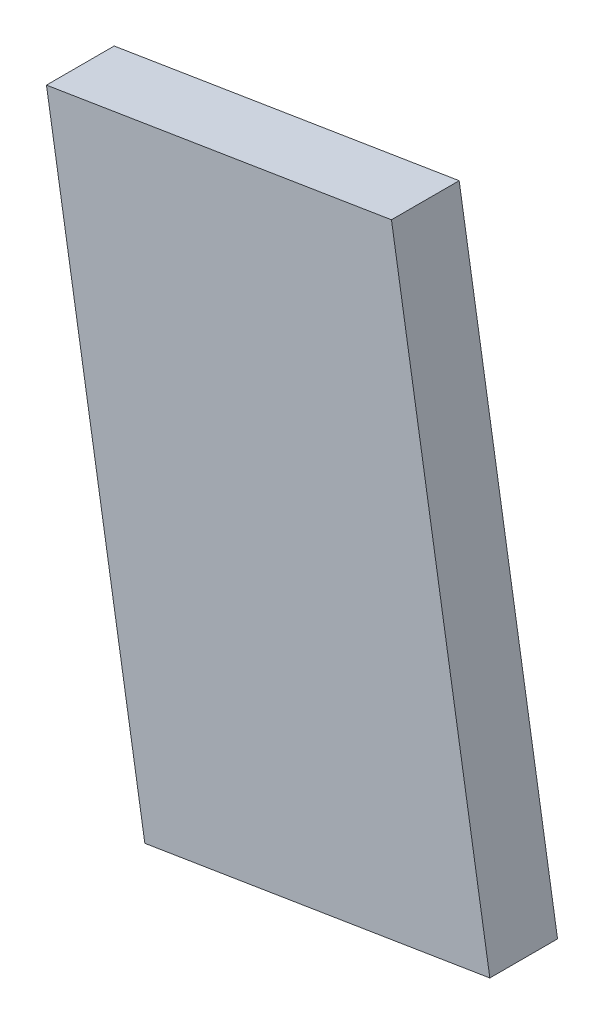
ISO-10303-21;
HEADER;
FILE_DESCRIPTION(('STEP AP214'),'2;1');
FILE_NAME('part.step','',(''),(''),'','','');
FILE_SCHEMA(('AUTOMOTIVE_DESIGN { 1 0 10303 214 1 1 1 1 }'));
ENDSEC;
DATA;
#1=APPLICATION_CONTEXT('core data for automotive mechanical design processes');
#2=APPLICATION_PROTOCOL_DEFINITION('international standard','automotive_design',2000,#1);
#3=PRODUCT_CONTEXT('',#1,'mechanical');
#4=PRODUCT('Part','Part','',(#3));
#5=PRODUCT_RELATED_PRODUCT_CATEGORY('part','',(#4));
#6=PRODUCT_DEFINITION_FORMATION('','',#4);
#7=PRODUCT_DEFINITION_CONTEXT('part definition',#1,'design');
#8=PRODUCT_DEFINITION('design','',#6,#7);
#9=PRODUCT_DEFINITION_SHAPE('','',#8);
#10=(LENGTH_UNIT() NAMED_UNIT(*) SI_UNIT(.MILLI.,.METRE.));
#11=(NAMED_UNIT(*) PLANE_ANGLE_UNIT() SI_UNIT($,.RADIAN.));
#12=(NAMED_UNIT(*) SI_UNIT($,.STERADIAN.) SOLID_ANGLE_UNIT());
#13=UNCERTAINTY_MEASURE_WITH_UNIT(LENGTH_MEASURE(1.E-05),#10,'distance_accuracy_value','');
#14=(GEOMETRIC_REPRESENTATION_CONTEXT(3) GLOBAL_UNCERTAINTY_ASSIGNED_CONTEXT((#13)) GLOBAL_UNIT_ASSIGNED_CONTEXT((#10,
#11,#12)) REPRESENTATION_CONTEXT('',''));
#15=CARTESIAN_POINT('',(0.,0.,0.));
#16=DIRECTION('',(0.,0.,1.));
#17=DIRECTION('',(1.,0.,0.));
#18=AXIS2_PLACEMENT_3D('',#15,#16,#17);
#19=CARTESIAN_POINT('',(-25.8847127648592,-44.2969727367285,-5.));
#20=DIRECTION('',(-0.987141734894597,-0.159847412332151,0.));
#21=DIRECTION('',(0.159847412332151,-0.987141734894597,0.));
#22=AXIS2_PLACEMENT_3D('',#19,#20,#21);
#23=PLANE('',#22);
#24=DIRECTION('',(0.,0.,1.));
#25=VECTOR('',#24,1.);
#26=CARTESIAN_POINT('',(-40.4124440524635,45.4193990086512,-5.));
#27=LINE('',#26,#25);
#28=CARTESIAN_POINT('',(-40.4124440524635,45.4193990086512,0.));
#29=VERTEX_POINT('',#28);
#30=CARTESIAN_POINT('',(-40.4124440524635,45.4193990086512,10.));
#31=VERTEX_POINT('',#30);
#32=EDGE_CURVE('E11',#29,#31,#27,.T.);
#33=ORIENTED_EDGE('',*,*,#32,.F.);
#34=DIRECTION('',(0.159847412332151,-0.987141734894597,0.));
#35=VECTOR('',#34,1.);
#36=CARTESIAN_POINT('',(-25.8847127648592,-44.2969727367285,0.));
#37=LINE('',#36,#35);
#38=CARTESIAN_POINT('',(-25.8847127648592,-44.2969727367285,0.));
#39=VERTEX_POINT('',#38);
#40=EDGE_CURVE('E106',#29,#39,#37,.T.);
#41=ORIENTED_EDGE('',*,*,#40,.T.);
#42=DIRECTION('',(0.,0.,1.));
#43=VECTOR('',#42,1.);
#44=CARTESIAN_POINT('',(-25.8847127648592,-44.2969727367285,-5.));
#45=LINE('',#44,#43);
#46=CARTESIAN_POINT('',(-25.8847127648592,-44.2969727367285,10.));
#47=VERTEX_POINT('',#46);
#48=EDGE_CURVE('E45',#39,#47,#45,.T.);
#49=ORIENTED_EDGE('',*,*,#48,.T.);
#50=DIRECTION('',(0.159847412332151,-0.987141734894597,0.));
#51=VECTOR('',#50,1.);
#52=CARTESIAN_POINT('',(-25.8847127648592,-44.2969727367285,10.));
#53=LINE('',#52,#51);
#54=EDGE_CURVE('E125',#31,#47,#53,.T.);
#55=ORIENTED_EDGE('',*,*,#54,.F.);
#56=EDGE_LOOP('',(#33,#41,#49,#55));
#57=FACE_BOUND('',#56,.T.);
#58=ADVANCED_FACE('F42',(#57),#23,.T.);
#59=CARTESIAN_POINT('',(-40.4124440524635,45.4193990086512,-5.));
#60=DIRECTION('',(-0.159847412332151,0.987141734894597,0.));
#61=DIRECTION('',(-0.987141734894597,-0.159847412332151,0.));
#62=AXIS2_PLACEMENT_3D('',#59,#60,#61);
#63=PLANE('',#62);
#64=DIRECTION('',(0.,0.,1.));
#65=VECTOR('',#64,1.);
#66=CARTESIAN_POINT('',(10.5406040311006,53.6702029192599,-5.));
#67=LINE('',#66,#65);
#68=CARTESIAN_POINT('',(10.5406040311006,53.6702029192599,0.));
#69=VERTEX_POINT('',#68);
#70=CARTESIAN_POINT('',(10.5406040311006,53.6702029192599,10.));
#71=VERTEX_POINT('',#70);
#72=EDGE_CURVE('E51',#69,#71,#67,.T.);
#73=ORIENTED_EDGE('',*,*,#72,.F.);
#74=DIRECTION('',(-0.987141734894597,-0.159847412332151,0.));
#75=VECTOR('',#74,1.);
#76=CARTESIAN_POINT('',(10.5406040311006,53.6702029192599,0.));
#77=LINE('',#76,#75);
#78=EDGE_CURVE('E109',#69,#29,#77,.T.);
#79=ORIENTED_EDGE('',*,*,#78,.T.);
#80=ORIENTED_EDGE('',*,*,#32,.T.);
#81=DIRECTION('',(-0.987141734894597,-0.159847412332151,0.));
#82=VECTOR('',#81,1.);
#83=CARTESIAN_POINT('',(-40.4124440524635,45.4193990086512,10.));
#84=LINE('',#83,#82);
#85=EDGE_CURVE('E145',#71,#31,#84,.T.);
#86=ORIENTED_EDGE('',*,*,#85,.F.);
#87=EDGE_LOOP('',(#73,#79,#80,#86));
#88=FACE_BOUND('',#87,.T.);
#89=ADVANCED_FACE('F118',(#88),#63,.T.);
#90=CARTESIAN_POINT('',(10.5406040311006,53.6702029192599,-5.));
#91=DIRECTION('',(0.987141734894597,0.159847412332151,0.));
#92=DIRECTION('',(-0.159847412332151,0.987141734894597,0.));
#93=AXIS2_PLACEMENT_3D('',#90,#91,#92);
#94=PLANE('',#93);
#95=DIRECTION('',(0.,0.,1.));
#96=VECTOR('',#95,1.);
#97=CARTESIAN_POINT('',(25.068335318705,-36.0461688261198,-5.));
#98=LINE('',#97,#96);
#99=CARTESIAN_POINT('',(25.068335318705,-36.0461688261198,0.));
#100=VERTEX_POINT('',#99);
#101=CARTESIAN_POINT('',(25.068335318705,-36.0461688261198,10.));
#102=VERTEX_POINT('',#101);
#103=EDGE_CURVE('E149',#100,#102,#98,.T.);
#104=ORIENTED_EDGE('',*,*,#103,.F.);
#105=DIRECTION('',(-0.159847412332151,0.987141734894597,0.));
#106=VECTOR('',#105,1.);
#107=CARTESIAN_POINT('',(25.068335318705,-36.0461688261198,0.));
#108=LINE('',#107,#106);
#109=EDGE_CURVE('E59',#100,#69,#108,.T.);
#110=ORIENTED_EDGE('',*,*,#109,.T.);
#111=ORIENTED_EDGE('',*,*,#72,.T.);
#112=DIRECTION('',(-0.159847412332151,0.987141734894597,0.));
#113=VECTOR('',#112,1.);
#114=CARTESIAN_POINT('',(10.5406040311006,53.6702029192599,10.));
#115=LINE('',#114,#113);
#116=EDGE_CURVE('E135',#102,#71,#115,.T.);
#117=ORIENTED_EDGE('',*,*,#116,.F.);
#118=EDGE_LOOP('',(#104,#110,#111,#117));
#119=FACE_BOUND('',#118,.T.);
#120=ADVANCED_FACE('F158',(#119),#94,.T.);
#121=CARTESIAN_POINT('',(25.068335318705,-36.0461688261198,-5.));
#122=DIRECTION('',(0.159847412332151,-0.987141734894597,0.));
#123=DIRECTION('',(0.987141734894597,0.159847412332151,0.));
#124=AXIS2_PLACEMENT_3D('',#121,#122,#123);
#125=PLANE('',#124);
#126=ORIENTED_EDGE('',*,*,#48,.F.);
#127=DIRECTION('',(0.987141734894597,0.159847412332151,0.));
#128=VECTOR('',#127,1.);
#129=CARTESIAN_POINT('',(25.068335318705,-36.0461688261198,0.));
#130=LINE('',#129,#128);
#131=EDGE_CURVE('E110',#39,#100,#130,.T.);
#132=ORIENTED_EDGE('',*,*,#131,.T.);
#133=ORIENTED_EDGE('',*,*,#103,.T.);
#134=DIRECTION('',(0.987141734894597,0.159847412332151,0.));
#135=VECTOR('',#134,1.);
#136=CARTESIAN_POINT('',(25.068335318705,-36.0461688261198,10.));
#137=LINE('',#136,#135);
#138=EDGE_CURVE('E130',#47,#102,#137,.T.);
#139=ORIENTED_EDGE('',*,*,#138,.F.);
#140=EDGE_LOOP('',(#126,#132,#133,#139));
#141=FACE_BOUND('',#140,.T.);
#142=ADVANCED_FACE('F154',(#141),#125,.T.);
#143=CARTESIAN_POINT('',(0.,0.,10.));
#144=DIRECTION('',(0.,0.,-1.));
#145=DIRECTION('',(-1.,0.,0.));
#146=AXIS2_PLACEMENT_3D('',#143,#144,#145);
#147=PLANE('',#146);
#148=ORIENTED_EDGE('',*,*,#54,.T.);
#149=ORIENTED_EDGE('',*,*,#138,.T.);
#150=ORIENTED_EDGE('',*,*,#116,.T.);
#151=ORIENTED_EDGE('',*,*,#85,.T.);
#152=EDGE_LOOP('',(#148,#149,#150,#151));
#153=FACE_BOUND('',#152,.T.);
#154=ADVANCED_FACE('F157',(#153),#147,.F.);
#155=CARTESIAN_POINT('',(-14.7251493712858,38.9053462899443,0.));
#156=DIRECTION('',(0.,0.,1.));
#157=DIRECTION('',(0.987141734894597,0.159847412332151,0.));
#158=AXIS2_PLACEMENT_3D('',#155,#156,#157);
#159=PLANE('',#158);
#160=ORIENTED_EDGE('',*,*,#40,.F.);
#161=ORIENTED_EDGE('',*,*,#78,.F.);
#162=ORIENTED_EDGE('',*,*,#109,.F.);
#163=ORIENTED_EDGE('',*,*,#131,.F.);
#164=EDGE_LOOP('',(#160,#161,#162,#163));
#165=FACE_BOUND('',#164,.T.);
#166=DIRECTION('',(-0.987141734894597,-0.159847412332152,0.));
#167=VECTOR('',#166,1.);
#168=CARTESIAN_POINT('',(-2.71979536533537,-35.2340208011674,0.));
#169=LINE('',#168,#167);
#170=CARTESIAN_POINT('',(9.66924925423723,-33.2278684385407,0.));
#171=VERTEX_POINT('',#170);
#172=CARTESIAN_POINT('',(-11.941637329775,-36.7273094778022,0.));
#173=VERTEX_POINT('',#172);
#174=EDGE_CURVE('E67',#171,#173,#169,.T.);
#175=ORIENTED_EDGE('',*,*,#174,.F.);
#176=DIRECTION('',(-0.0158455206077221,0.999874451857167,0.));
#177=VECTOR('',#176,1.);
#178=CARTESIAN_POINT('',(8.52027945544598,39.2737284611511,0.));
#179=LINE('',#178,#177);
#180=CARTESIAN_POINT('',(8.38451657487172,47.840555588976,0.));
#181=VERTEX_POINT('',#180);
#182=EDGE_CURVE('E328',#171,#181,#179,.T.);
#183=ORIENTED_EDGE('',*,*,#182,.T.);
#184=DIRECTION('',(-0.987141734894597,-0.159847412332152,0.));
#185=VECTOR('',#184,1.);
#186=CARTESIAN_POINT('',(-15.544574794712,43.9657287027477,0.));
#187=LINE('',#186,#185);
#188=CARTESIAN_POINT('',(-36.3064635091651,40.6037655025111,0.));
#189=VERTEX_POINT('',#188);
#190=EDGE_CURVE('E169',#181,#189,#187,.T.);
#191=ORIENTED_EDGE('',*,*,#190,.T.);
#192=DIRECTION('',(-0.300508706231217,0.953779071629924,0.));
#193=VECTOR('',#192,1.);
#194=CARTESIAN_POINT('',(-33.8707534508525,32.8731100173098,0.));
#195=LINE('',#194,#193);
#196=EDGE_CURVE('E318',#173,#189,#195,.T.);
#197=ORIENTED_EDGE('',*,*,#196,.F.);
#198=EDGE_LOOP('',(#175,#183,#191,#197));
#199=FACE_BOUND('',#198,.T.);
#200=ADVANCED_FACE('F108',(#165,#199),#159,.F.);
#201=CARTESIAN_POINT('',(-30.4593264736482,40.3490836158088,6.72646261734246));
#202=CARTESIAN_POINT('',(-25.1720851942232,7.97858668458889,0.997394867249843));
#203=CARTESIAN_POINT('',(-17.4820683826351,-19.0246435672898,0.0433622435790926));
#204=CARTESIAN_POINT('',(-7.73997960242745,-36.9103197460374,4.83352681187375));
#205=B_SPLINE_CURVE_WITH_KNOTS('',3,(#201,#202,#203,#204),.UNSPECIFIED.,.F.,.F.,(4,4),(0.,1.),.UNSPECIFIED.);
#206=CARTESIAN_POINT('',(-13.2121616669834,39.5978543481271,26.567353744485));
#207=DIRECTION('',(0.157418970963642,-0.972144833846121,-0.173648177666931));
#208=AXIS1_PLACEMENT('',#206,#207);
#209=SURFACE_OF_REVOLUTION('',#205,#208);
#210=CARTESIAN_POINT('',(-0.774096655798974,-37.2137304922912,12.8469786862982));
#211=DIRECTION('',(0.157418970963642,-0.972144833846121,-0.173648177666931));
#212=DIRECTION('',(0.613259218295727,0.23405972265733,-0.754406506735519));
#213=AXIS2_PLACEMENT_3D('',#210,#211,#212);
#214=CIRCLE('',#213,10.6221934764336);
#215=CARTESIAN_POINT('',(-7.73997960242747,-36.9103197460374,4.83352681187373));
#216=VERTEX_POINT('',#215);
#217=CARTESIAN_POINT('',(5.74006141214467,-34.7275028331846,4.83352681187308));
#218=VERTEX_POINT('',#217);
#219=EDGE_CURVE('E138',#216,#218,#214,.T.);
#220=ORIENTED_EDGE('',*,*,#219,.F.);
#221=CARTESIAN_POINT('',(-30.4593264736482,40.3490836158088,6.72646261734246));
#222=VERTEX_POINT('',#221);
#223=EDGE_CURVE('E184',#222,#216,#205,.T.);
#224=ORIENTED_EDGE('',*,*,#223,.F.);
#225=CARTESIAN_POINT('',(-13.2121616669834,39.5978543481271,26.567353744485));
#226=DIRECTION('',(0.157418970963642,-0.972144833846121,-0.173648177666931));
#227=DIRECTION('',(0.613259218295727,0.23405972265733,-0.754406506735519));
#228=AXIS2_PLACEMENT_3D('',#225,#226,#227);
#229=CIRCLE('',#228,26.3);
#230=CARTESIAN_POINT('',(2.91655577419422,45.7536250540149,6.72646261734084));
#231=VERTEX_POINT('',#230);
#232=EDGE_CURVE('E131',#222,#231,#229,.T.);
#233=ORIENTED_EDGE('',*,*,#232,.T.);
#234=CARTESIAN_POINT('',(2.91655577419422,45.7536250540149,6.72646261734084));
#235=CARTESIAN_POINT('',(8.11511942848971,13.3687685952746,0.997394867248234));
#236=CARTESIAN_POINT('',(9.33987107889558,-14.6813791047521,0.043362243577795));
#237=CARTESIAN_POINT('',(5.74006141214466,-34.7275028331847,4.83352681187309));
#238=B_SPLINE_CURVE_WITH_KNOTS('',3,(#234,#235,#236,#237),.UNSPECIFIED.,.F.,.F.,(4,4),(0.,1.),.UNSPECIFIED.);
#239=EDGE_CURVE('E168',#231,#218,#238,.T.);
#240=ORIENTED_EDGE('',*,*,#239,.T.);
#241=EDGE_LOOP('',(#220,#224,#233,#240));
#242=FACE_BOUND('',#241,.T.);
#243=ADVANCED_FACE('F196',(#242),#209,.T.);
#244=CARTESIAN_POINT('',(-13.2121616669834,39.5978543481271,26.567353744485));
#245=DIRECTION('',(0.774036432447506,0.0122665502840818,0.633022221559454));
#246=DIRECTION('',(0.613259218295727,0.234059722657329,-0.754406506735519));
#247=AXIS2_PLACEMENT_3D('',#244,#245,#246);
#248=PLANE('',#247);
#249=DIRECTION('',(-0.613259218295727,-0.234059722657329,0.754406506735519));
#250=VECTOR('',#249,1.);
#251=CARTESIAN_POINT('',(-13.2121616669834,39.5978543481271,26.567353744485));
#252=LINE('',#251,#250);
#253=EDGE_CURVE('E165',#181,#231,#252,.T.);
#254=ORIENTED_EDGE('',*,*,#253,.F.);
#255=ORIENTED_EDGE('',*,*,#182,.F.);
#256=DIRECTION('',(-0.613259218295727,-0.234059722657329,0.754406506735519));
#257=VECTOR('',#256,1.);
#258=CARTESIAN_POINT('',(-0.774096655798979,-37.2137304922912,12.8469786862982));
#259=LINE('',#258,#257);
#260=EDGE_CURVE('E175',#171,#218,#259,.T.);
#261=ORIENTED_EDGE('',*,*,#260,.T.);
#262=ORIENTED_EDGE('',*,*,#239,.F.);
#263=EDGE_LOOP('',(#254,#255,#261,#262));
#264=FACE_BOUND('',#263,.T.);
#265=ADVANCED_FACE('F200',(#264),#248,.F.);
#266=CARTESIAN_POINT('',(-13.2121616669834,39.5978543481271,26.567353744485));
#267=DIRECTION('',(0.738352448726157,0.232633893643916,-0.633022221559527));
#268=DIRECTION('',(-0.655785734093717,0.0285638504821938,-0.754406506735458));
#269=AXIS2_PLACEMENT_3D('',#266,#267,#268);
#270=PLANE('',#269);
#271=ORIENTED_EDGE('',*,*,#196,.T.);
#272=DIRECTION('',(0.655785734093717,-0.0285638504821938,0.754406506735458));
#273=VECTOR('',#272,1.);
#274=CARTESIAN_POINT('',(-13.2121616669834,39.5978543481271,26.567353744485));
#275=LINE('',#274,#273);
#276=EDGE_CURVE('E181',#189,#222,#275,.T.);
#277=ORIENTED_EDGE('',*,*,#276,.T.);
#278=ORIENTED_EDGE('',*,*,#223,.T.);
#279=DIRECTION('',(0.655785734093717,-0.0285638504821938,0.754406506735458));
#280=VECTOR('',#279,1.);
#281=CARTESIAN_POINT('',(-0.774096655798967,-37.2137304922912,12.8469786862982));
#282=LINE('',#281,#280);
#283=EDGE_CURVE('E191',#173,#216,#282,.T.);
#284=ORIENTED_EDGE('',*,*,#283,.F.);
#285=EDGE_LOOP('',(#271,#277,#278,#284));
#286=FACE_BOUND('',#285,.T.);
#287=ADVANCED_FACE('F252',(#286),#270,.T.);
#288=CARTESIAN_POINT('',(-0.774096655798967,-37.2137304922912,12.8469786862982));
#289=DIRECTION('',(-0.157418970963642,0.972144833846121,0.173648177666931));
#290=DIRECTION('',(-0.613259218295727,-0.23405972265733,0.754406506735519));
#291=AXIS2_PLACEMENT_3D('',#288,#289,#290);
#292=PLANE('',#291);
#293=ORIENTED_EDGE('',*,*,#174,.T.);
#294=ORIENTED_EDGE('',*,*,#283,.T.);
#295=ORIENTED_EDGE('',*,*,#219,.T.);
#296=ORIENTED_EDGE('',*,*,#260,.F.);
#297=EDGE_LOOP('',(#293,#294,#295,#296));
#298=FACE_BOUND('',#297,.T.);
#299=ADVANCED_FACE('F202',(#298),#292,.T.);
#300=CARTESIAN_POINT('',(-13.2121616669834,39.5978543481271,26.567353744485));
#301=DIRECTION('',(-0.157418970963642,0.972144833846121,0.173648177666931));
#302=DIRECTION('',(-0.613259218295727,-0.23405972265733,0.754406506735519));
#303=AXIS2_PLACEMENT_3D('',#300,#301,#302);
#304=PLANE('',#303);
#305=ORIENTED_EDGE('',*,*,#276,.F.);
#306=ORIENTED_EDGE('',*,*,#190,.F.);
#307=ORIENTED_EDGE('',*,*,#253,.T.);
#308=ORIENTED_EDGE('',*,*,#232,.F.);
#309=EDGE_LOOP('',(#305,#306,#307,#308));
#310=FACE_BOUND('',#309,.T.);
#311=ADVANCED_FACE('F204',(#310),#304,.F.);
#312=CLOSED_SHELL('',(#58,#89,#120,#142,#154,#200,#243,#265,#287,#299,#311));
#313=MANIFOLD_SOLID_BREP('B2',#312);
#314=ADVANCED_BREP_SHAPE_REPRESENTATION('',(#18,#313),#14);
#315=SHAPE_DEFINITION_REPRESENTATION(#9,#314);
ENDSEC;
END-ISO-10303-21;
